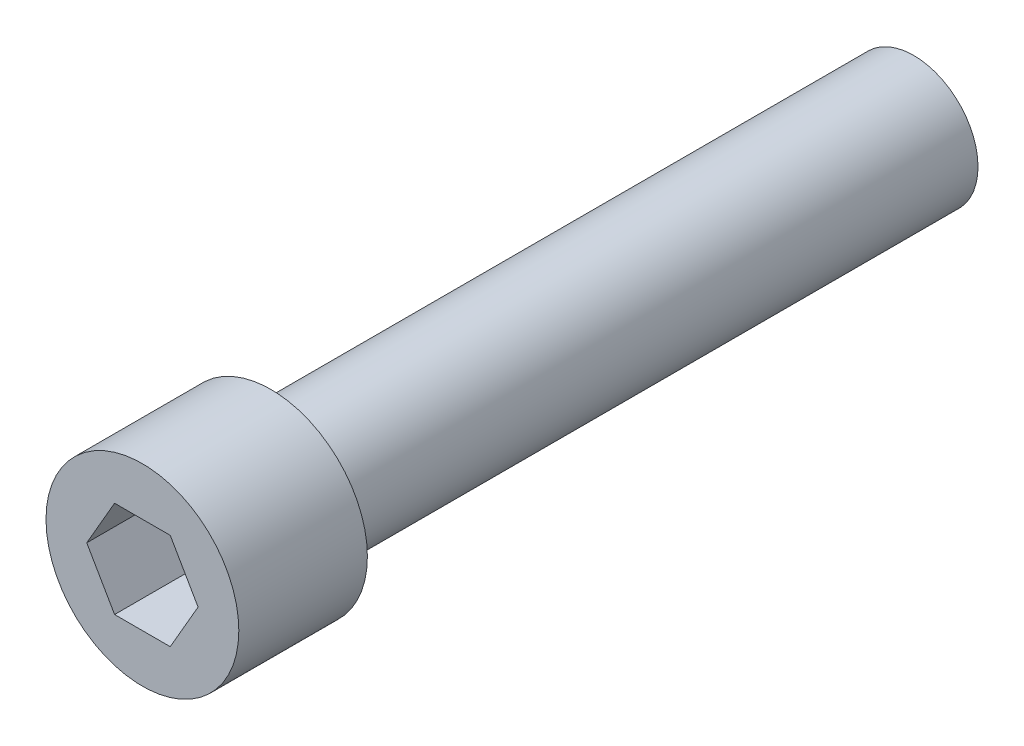
ISO-10303-21;
HEADER;
FILE_DESCRIPTION(('STEP AP214'),'2;1');
FILE_NAME('part.step','',(''),(''),'','','');
FILE_SCHEMA(('AUTOMOTIVE_DESIGN { 1 0 10303 214 1 1 1 1 }'));
ENDSEC;
DATA;
#1=APPLICATION_CONTEXT('core data for automotive mechanical design processes');
#2=APPLICATION_PROTOCOL_DEFINITION('international standard','automotive_design',2000,#1);
#3=PRODUCT_CONTEXT('',#1,'mechanical');
#4=PRODUCT('Part','Part','',(#3));
#5=PRODUCT_RELATED_PRODUCT_CATEGORY('part','',(#4));
#6=PRODUCT_DEFINITION_FORMATION('','',#4);
#7=PRODUCT_DEFINITION_CONTEXT('part definition',#1,'design');
#8=PRODUCT_DEFINITION('design','',#6,#7);
#9=PRODUCT_DEFINITION_SHAPE('','',#8);
#10=(LENGTH_UNIT() NAMED_UNIT(*) SI_UNIT(.MILLI.,.METRE.));
#11=(NAMED_UNIT(*) PLANE_ANGLE_UNIT() SI_UNIT($,.RADIAN.));
#12=(NAMED_UNIT(*) SI_UNIT($,.STERADIAN.) SOLID_ANGLE_UNIT());
#13=UNCERTAINTY_MEASURE_WITH_UNIT(LENGTH_MEASURE(1.E-05),#10,'distance_accuracy_value','');
#14=(GEOMETRIC_REPRESENTATION_CONTEXT(3) GLOBAL_UNCERTAINTY_ASSIGNED_CONTEXT((#13)) GLOBAL_UNIT_ASSIGNED_CONTEXT((#10,
#11,#12)) REPRESENTATION_CONTEXT('',''));
#15=CARTESIAN_POINT('',(0.,0.,0.));
#16=DIRECTION('',(0.,0.,1.));
#17=DIRECTION('',(1.,0.,0.));
#18=AXIS2_PLACEMENT_3D('',#15,#16,#17);
#19=CARTESIAN_POINT('',(0.,0.,31.75));
#20=DIRECTION('',(0.,0.,-1.));
#21=DIRECTION('',(-1.,0.,0.));
#22=AXIS2_PLACEMENT_3D('',#19,#20,#21);
#23=CYLINDRICAL_SURFACE('',#22,3.175);
#24=CARTESIAN_POINT('',(0.,0.,31.75));
#25=DIRECTION('',(0.,0.,1.));
#26=DIRECTION('',(1.,0.,0.));
#27=AXIS2_PLACEMENT_3D('',#24,#25,#26);
#28=CIRCLE('',#27,3.175);
#29=CARTESIAN_POINT('',(3.175,0.,31.75));
#30=VERTEX_POINT('',#29);
#31=EDGE_CURVE('E11',#30,#30,#28,.T.);
#32=ORIENTED_EDGE('',*,*,#31,.F.);
#33=EDGE_LOOP('',(#32));
#34=FACE_BOUND('',#33,.T.);
#35=CARTESIAN_POINT('',(0.,0.,0.));
#36=DIRECTION('',(0.,0.,1.));
#37=DIRECTION('',(1.,0.,0.));
#38=AXIS2_PLACEMENT_3D('',#35,#36,#37);
#39=CIRCLE('',#38,3.175);
#40=CARTESIAN_POINT('',(3.175,0.,0.));
#41=VERTEX_POINT('',#40);
#42=EDGE_CURVE('E36',#41,#41,#39,.T.);
#43=ORIENTED_EDGE('',*,*,#42,.T.);
#44=EDGE_LOOP('',(#43));
#45=FACE_BOUND('',#44,.T.);
#46=ADVANCED_FACE('F33',(#34,#45),#23,.T.);
#47=CARTESIAN_POINT('',(0.,0.,0.));
#48=DIRECTION('',(0.,0.,1.));
#49=DIRECTION('',(1.,0.,0.));
#50=AXIS2_PLACEMENT_3D('',#47,#48,#49);
#51=PLANE('',#50);
#52=ORIENTED_EDGE('',*,*,#42,.F.);
#53=EDGE_LOOP('',(#52));
#54=FACE_BOUND('',#53,.T.);
#55=ADVANCED_FACE('F151',(#54),#51,.F.);
#56=CARTESIAN_POINT('',(0.,0.,31.75));
#57=DIRECTION('',(0.,0.,1.));
#58=DIRECTION('',(1.,0.,0.));
#59=AXIS2_PLACEMENT_3D('',#56,#57,#58);
#60=PLANE('',#59);
#61=CARTESIAN_POINT('',(0.,0.,31.75));
#62=DIRECTION('',(0.,0.,1.));
#63=DIRECTION('',(1.,0.,0.));
#64=AXIS2_PLACEMENT_3D('',#61,#62,#63);
#65=CIRCLE('',#64,4.7625);
#66=CARTESIAN_POINT('',(4.7625,0.,31.75));
#67=VERTEX_POINT('',#66);
#68=EDGE_CURVE('E134',#67,#67,#65,.T.);
#69=ORIENTED_EDGE('',*,*,#68,.F.);
#70=EDGE_LOOP('',(#69));
#71=FACE_BOUND('',#70,.T.);
#72=ORIENTED_EDGE('',*,*,#31,.T.);
#73=EDGE_LOOP('',(#72));
#74=FACE_BOUND('',#73,.T.);
#75=ADVANCED_FACE('F148',(#71,#74),#60,.F.);
#76=CARTESIAN_POINT('',(0.,0.,38.1));
#77=DIRECTION('',(0.,0.,-1.));
#78=DIRECTION('',(-1.,0.,0.));
#79=AXIS2_PLACEMENT_3D('',#76,#77,#78);
#80=CYLINDRICAL_SURFACE('',#79,4.7625);
#81=CARTESIAN_POINT('',(0.,0.,38.1));
#82=DIRECTION('',(0.,0.,1.));
#83=DIRECTION('',(1.,0.,0.));
#84=AXIS2_PLACEMENT_3D('',#81,#82,#83);
#85=CIRCLE('',#84,4.7625);
#86=CARTESIAN_POINT('',(4.7625,0.,38.1));
#87=VERTEX_POINT('',#86);
#88=EDGE_CURVE('E140',#87,#87,#85,.T.);
#89=ORIENTED_EDGE('',*,*,#88,.F.);
#90=EDGE_LOOP('',(#89));
#91=FACE_BOUND('',#90,.T.);
#92=ORIENTED_EDGE('',*,*,#68,.T.);
#93=EDGE_LOOP('',(#92));
#94=FACE_BOUND('',#93,.T.);
#95=ADVANCED_FACE('F146',(#91,#94),#80,.T.);
#96=CARTESIAN_POINT('',(0.,0.,38.1));
#97=DIRECTION('',(0.,0.,1.));
#98=DIRECTION('',(1.,0.,0.));
#99=AXIS2_PLACEMENT_3D('',#96,#97,#98);
#100=PLANE('',#99);
#101=DIRECTION('',(0.5,0.866025403784439,0.));
#102=VECTOR('',#101,1.);
#103=CARTESIAN_POINT('',(1.3748153285078,-2.38125,38.1));
#104=LINE('',#103,#102);
#105=CARTESIAN_POINT('',(1.3748153285078,-2.38125,38.1));
#106=VERTEX_POINT('',#105);
#107=CARTESIAN_POINT('',(2.74963065701559,0.,38.1));
#108=VERTEX_POINT('',#107);
#109=EDGE_CURVE('E47',#106,#108,#104,.T.);
#110=ORIENTED_EDGE('',*,*,#109,.F.);
#111=DIRECTION('',(1.,0.,0.));
#112=VECTOR('',#111,1.);
#113=CARTESIAN_POINT('',(-1.3748153285078,-2.38125,38.1));
#114=LINE('',#113,#112);
#115=CARTESIAN_POINT('',(-1.3748153285078,-2.38125,38.1));
#116=VERTEX_POINT('',#115);
#117=EDGE_CURVE('E130',#116,#106,#114,.T.);
#118=ORIENTED_EDGE('',*,*,#117,.F.);
#119=DIRECTION('',(0.5,-0.866025403784439,0.));
#120=VECTOR('',#119,1.);
#121=CARTESIAN_POINT('',(-2.74963065701559,0.,38.1));
#122=LINE('',#121,#120);
#123=CARTESIAN_POINT('',(-2.74963065701559,0.,38.1));
#124=VERTEX_POINT('',#123);
#125=EDGE_CURVE('E128',#124,#116,#122,.T.);
#126=ORIENTED_EDGE('',*,*,#125,.F.);
#127=DIRECTION('',(-0.5,-0.866025403784439,0.));
#128=VECTOR('',#127,1.);
#129=CARTESIAN_POINT('',(-1.3748153285078,2.38125,38.1));
#130=LINE('',#129,#128);
#131=CARTESIAN_POINT('',(-1.3748153285078,2.38125,38.1));
#132=VERTEX_POINT('',#131);
#133=EDGE_CURVE('E95',#132,#124,#130,.T.);
#134=ORIENTED_EDGE('',*,*,#133,.F.);
#135=DIRECTION('',(-1.,0.,0.));
#136=VECTOR('',#135,1.);
#137=CARTESIAN_POINT('',(1.3748153285078,2.38125,38.1));
#138=LINE('',#137,#136);
#139=CARTESIAN_POINT('',(1.3748153285078,2.38125,38.1));
#140=VERTEX_POINT('',#139);
#141=EDGE_CURVE('E124',#140,#132,#138,.T.);
#142=ORIENTED_EDGE('',*,*,#141,.F.);
#143=DIRECTION('',(-0.5,0.866025403784439,0.));
#144=VECTOR('',#143,1.);
#145=CARTESIAN_POINT('',(2.74963065701559,0.,38.1));
#146=LINE('',#145,#144);
#147=EDGE_CURVE('E121',#108,#140,#146,.T.);
#148=ORIENTED_EDGE('',*,*,#147,.F.);
#149=EDGE_LOOP('',(#110,#118,#126,#134,#142,#148));
#150=FACE_BOUND('',#149,.T.);
#151=ORIENTED_EDGE('',*,*,#88,.T.);
#152=EDGE_LOOP('',(#151));
#153=FACE_BOUND('',#152,.T.);
#154=ADVANCED_FACE('F165',(#150,#153),#100,.T.);
#155=CARTESIAN_POINT('',(1.3748153285078,-2.38125,34.5186));
#156=DIRECTION('',(0.866025403784439,-0.5,0.));
#157=DIRECTION('',(0.5,0.866025403784439,0.));
#158=AXIS2_PLACEMENT_3D('',#155,#156,#157);
#159=PLANE('',#158);
#160=ORIENTED_EDGE('',*,*,#109,.T.);
#161=DIRECTION('',(0.,0.,1.));
#162=VECTOR('',#161,1.);
#163=CARTESIAN_POINT('',(2.74963065701559,0.,34.5186));
#164=LINE('',#163,#162);
#165=CARTESIAN_POINT('',(2.74963065701559,0.,34.5186));
#166=VERTEX_POINT('',#165);
#167=EDGE_CURVE('E77',#166,#108,#164,.T.);
#168=ORIENTED_EDGE('',*,*,#167,.F.);
#169=DIRECTION('',(0.5,0.866025403784439,0.));
#170=VECTOR('',#169,1.);
#171=CARTESIAN_POINT('',(1.3748153285078,-2.38125,34.5186));
#172=LINE('',#171,#170);
#173=CARTESIAN_POINT('',(1.3748153285078,-2.38125,34.5186));
#174=VERTEX_POINT('',#173);
#175=EDGE_CURVE('E132',#174,#166,#172,.T.);
#176=ORIENTED_EDGE('',*,*,#175,.F.);
#177=DIRECTION('',(0.,0.,1.));
#178=VECTOR('',#177,1.);
#179=CARTESIAN_POINT('',(1.3748153285078,-2.38125,34.5186));
#180=LINE('',#179,#178);
#181=EDGE_CURVE('E55',#174,#106,#180,.T.);
#182=ORIENTED_EDGE('',*,*,#181,.T.);
#183=EDGE_LOOP('',(#160,#168,#176,#182));
#184=FACE_BOUND('',#183,.T.);
#185=ADVANCED_FACE('F170',(#184),#159,.F.);
#186=CARTESIAN_POINT('',(-1.3748153285078,-2.38125,34.5186));
#187=DIRECTION('',(0.,-1.,0.));
#188=DIRECTION('',(1.,0.,0.));
#189=AXIS2_PLACEMENT_3D('',#186,#187,#188);
#190=PLANE('',#189);
#191=ORIENTED_EDGE('',*,*,#117,.T.);
#192=ORIENTED_EDGE('',*,*,#181,.F.);
#193=DIRECTION('',(1.,0.,0.));
#194=VECTOR('',#193,1.);
#195=CARTESIAN_POINT('',(-1.3748153285078,-2.38125,34.5186));
#196=LINE('',#195,#194);
#197=CARTESIAN_POINT('',(-1.3748153285078,-2.38125,34.5186));
#198=VERTEX_POINT('',#197);
#199=EDGE_CURVE('E107',#198,#174,#196,.T.);
#200=ORIENTED_EDGE('',*,*,#199,.F.);
#201=DIRECTION('',(0.,0.,1.));
#202=VECTOR('',#201,1.);
#203=CARTESIAN_POINT('',(-1.3748153285078,-2.38125,34.5186));
#204=LINE('',#203,#202);
#205=EDGE_CURVE('E99',#198,#116,#204,.T.);
#206=ORIENTED_EDGE('',*,*,#205,.T.);
#207=EDGE_LOOP('',(#191,#192,#200,#206));
#208=FACE_BOUND('',#207,.T.);
#209=ADVANCED_FACE('F174',(#208),#190,.F.);
#210=CARTESIAN_POINT('',(-2.74963065701559,0.,34.5186));
#211=DIRECTION('',(-0.866025403784439,-0.5,0.));
#212=DIRECTION('',(0.5,-0.866025403784439,0.));
#213=AXIS2_PLACEMENT_3D('',#210,#211,#212);
#214=PLANE('',#213);
#215=ORIENTED_EDGE('',*,*,#125,.T.);
#216=ORIENTED_EDGE('',*,*,#205,.F.);
#217=DIRECTION('',(0.5,-0.866025403784439,0.));
#218=VECTOR('',#217,1.);
#219=CARTESIAN_POINT('',(-2.74963065701559,0.,34.5186));
#220=LINE('',#219,#218);
#221=CARTESIAN_POINT('',(-2.74963065701559,0.,34.5186));
#222=VERTEX_POINT('',#221);
#223=EDGE_CURVE('E103',#222,#198,#220,.T.);
#224=ORIENTED_EDGE('',*,*,#223,.F.);
#225=DIRECTION('',(0.,0.,1.));
#226=VECTOR('',#225,1.);
#227=CARTESIAN_POINT('',(-2.74963065701559,0.,34.5186));
#228=LINE('',#227,#226);
#229=EDGE_CURVE('E88',#222,#124,#228,.T.);
#230=ORIENTED_EDGE('',*,*,#229,.T.);
#231=EDGE_LOOP('',(#215,#216,#224,#230));
#232=FACE_BOUND('',#231,.T.);
#233=ADVANCED_FACE('F104',(#232),#214,.F.);
#234=CARTESIAN_POINT('',(-1.3748153285078,2.38125,34.5186));
#235=DIRECTION('',(-0.866025403784439,0.5,0.));
#236=DIRECTION('',(-0.5,-0.866025403784439,0.));
#237=AXIS2_PLACEMENT_3D('',#234,#235,#236);
#238=PLANE('',#237);
#239=ORIENTED_EDGE('',*,*,#133,.T.);
#240=ORIENTED_EDGE('',*,*,#229,.F.);
#241=DIRECTION('',(-0.5,-0.866025403784439,0.));
#242=VECTOR('',#241,1.);
#243=CARTESIAN_POINT('',(-1.3748153285078,2.38125,34.5186));
#244=LINE('',#243,#242);
#245=CARTESIAN_POINT('',(-1.3748153285078,2.38125,34.5186));
#246=VERTEX_POINT('',#245);
#247=EDGE_CURVE('E92',#246,#222,#244,.T.);
#248=ORIENTED_EDGE('',*,*,#247,.F.);
#249=DIRECTION('',(0.,0.,1.));
#250=VECTOR('',#249,1.);
#251=CARTESIAN_POINT('',(-1.3748153285078,2.38125,34.5186));
#252=LINE('',#251,#250);
#253=EDGE_CURVE('E100',#246,#132,#252,.T.);
#254=ORIENTED_EDGE('',*,*,#253,.T.);
#255=EDGE_LOOP('',(#239,#240,#248,#254));
#256=FACE_BOUND('',#255,.T.);
#257=ADVANCED_FACE('F90',(#256),#238,.F.);
#258=CARTESIAN_POINT('',(1.3748153285078,2.38125,34.5186));
#259=DIRECTION('',(0.,1.,0.));
#260=DIRECTION('',(0.,0.,1.));
#261=AXIS2_PLACEMENT_3D('',#258,#259,#260);
#262=PLANE('',#261);
#263=ORIENTED_EDGE('',*,*,#141,.T.);
#264=ORIENTED_EDGE('',*,*,#253,.F.);
#265=DIRECTION('',(-1.,0.,0.));
#266=VECTOR('',#265,1.);
#267=CARTESIAN_POINT('',(1.3748153285078,2.38125,34.5186));
#268=LINE('',#267,#266);
#269=CARTESIAN_POINT('',(1.3748153285078,2.38125,34.5186));
#270=VERTEX_POINT('',#269);
#271=EDGE_CURVE('E113',#270,#246,#268,.T.);
#272=ORIENTED_EDGE('',*,*,#271,.F.);
#273=DIRECTION('',(0.,0.,1.));
#274=VECTOR('',#273,1.);
#275=CARTESIAN_POINT('',(1.3748153285078,2.38125,34.5186));
#276=LINE('',#275,#274);
#277=EDGE_CURVE('E137',#270,#140,#276,.T.);
#278=ORIENTED_EDGE('',*,*,#277,.T.);
#279=EDGE_LOOP('',(#263,#264,#272,#278));
#280=FACE_BOUND('',#279,.T.);
#281=ADVANCED_FACE('F178',(#280),#262,.F.);
#282=CARTESIAN_POINT('',(2.74963065701559,0.,34.5186));
#283=DIRECTION('',(0.866025403784439,0.5,0.));
#284=DIRECTION('',(-0.5,0.866025403784439,0.));
#285=AXIS2_PLACEMENT_3D('',#282,#283,#284);
#286=PLANE('',#285);
#287=ORIENTED_EDGE('',*,*,#147,.T.);
#288=ORIENTED_EDGE('',*,*,#277,.F.);
#289=DIRECTION('',(-0.5,0.866025403784439,0.));
#290=VECTOR('',#289,1.);
#291=CARTESIAN_POINT('',(2.74963065701559,0.,34.5186));
#292=LINE('',#291,#290);
#293=EDGE_CURVE('E115',#166,#270,#292,.T.);
#294=ORIENTED_EDGE('',*,*,#293,.F.);
#295=ORIENTED_EDGE('',*,*,#167,.T.);
#296=EDGE_LOOP('',(#287,#288,#294,#295));
#297=FACE_BOUND('',#296,.T.);
#298=ADVANCED_FACE('F175',(#297),#286,.F.);
#299=CARTESIAN_POINT('',(0.,0.,34.5186));
#300=DIRECTION('',(0.,0.,1.));
#301=DIRECTION('',(1.,0.,0.));
#302=AXIS2_PLACEMENT_3D('',#299,#300,#301);
#303=PLANE('',#302);
#304=ORIENTED_EDGE('',*,*,#175,.T.);
#305=ORIENTED_EDGE('',*,*,#293,.T.);
#306=ORIENTED_EDGE('',*,*,#271,.T.);
#307=ORIENTED_EDGE('',*,*,#247,.T.);
#308=ORIENTED_EDGE('',*,*,#223,.T.);
#309=ORIENTED_EDGE('',*,*,#199,.T.);
#310=EDGE_LOOP('',(#304,#305,#306,#307,#308,#309));
#311=FACE_BOUND('',#310,.T.);
#312=ADVANCED_FACE('F110',(#311),#303,.T.);
#313=CLOSED_SHELL('',(#46,#55,#75,#95,#154,#185,#209,#233,#257,#281,#298,#312));
#314=MANIFOLD_SOLID_BREP('B2',#313);
#315=ADVANCED_BREP_SHAPE_REPRESENTATION('',(#18,#314),#14);
#316=SHAPE_DEFINITION_REPRESENTATION(#9,#315);
ENDSEC;
END-ISO-10303-21;
